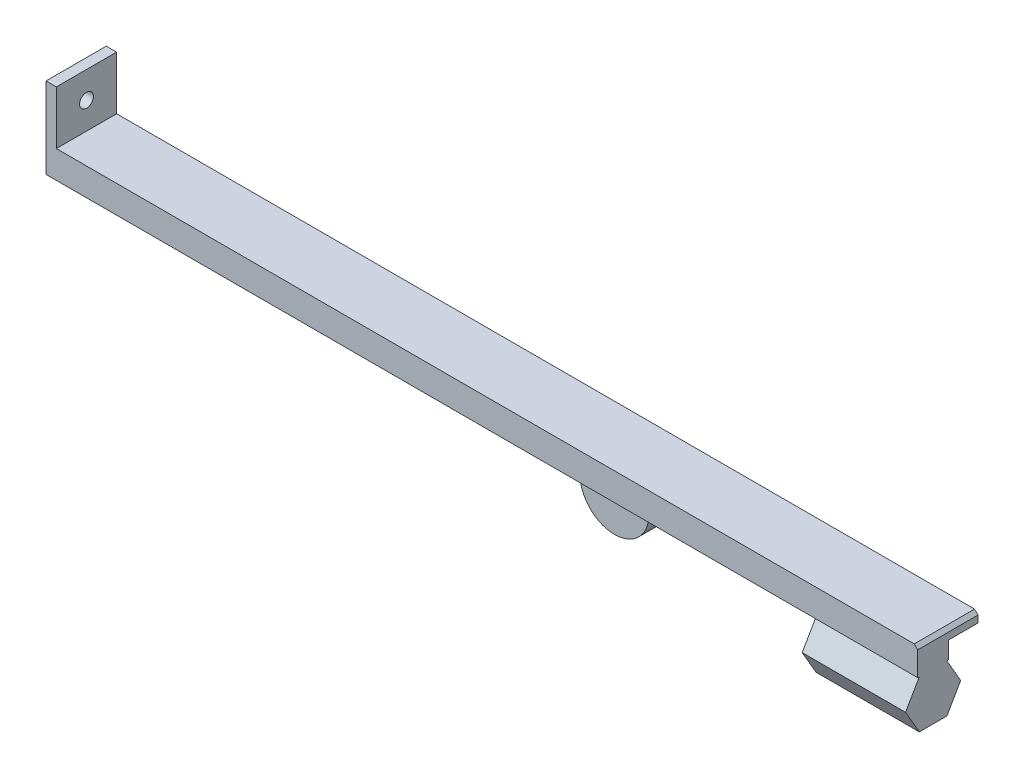
ISO-10303-21;
HEADER;
FILE_DESCRIPTION(('STEP AP214'),'2;1');
FILE_NAME('part.step','',(''),(''),'','','');
FILE_SCHEMA(('AUTOMOTIVE_DESIGN { 1 0 10303 214 1 1 1 1 }'));
ENDSEC;
DATA;
#1=APPLICATION_CONTEXT('core data for automotive mechanical design processes');
#2=APPLICATION_PROTOCOL_DEFINITION('international standard','automotive_design',2000,#1);
#3=PRODUCT_CONTEXT('',#1,'mechanical');
#4=PRODUCT('Part','Part','',(#3));
#5=PRODUCT_RELATED_PRODUCT_CATEGORY('part','',(#4));
#6=PRODUCT_DEFINITION_FORMATION('','',#4);
#7=PRODUCT_DEFINITION_CONTEXT('part definition',#1,'design');
#8=PRODUCT_DEFINITION('design','',#6,#7);
#9=PRODUCT_DEFINITION_SHAPE('','',#8);
#10=(LENGTH_UNIT() NAMED_UNIT(*) SI_UNIT(.MILLI.,.METRE.));
#11=(NAMED_UNIT(*) PLANE_ANGLE_UNIT() SI_UNIT($,.RADIAN.));
#12=(NAMED_UNIT(*) SI_UNIT($,.STERADIAN.) SOLID_ANGLE_UNIT());
#13=UNCERTAINTY_MEASURE_WITH_UNIT(LENGTH_MEASURE(1.E-05),#10,'distance_accuracy_value','');
#14=(GEOMETRIC_REPRESENTATION_CONTEXT(3) GLOBAL_UNCERTAINTY_ASSIGNED_CONTEXT((#13)) GLOBAL_UNIT_ASSIGNED_CONTEXT((#10,
#11,#12)) REPRESENTATION_CONTEXT('',''));
#15=CARTESIAN_POINT('',(0.,0.,0.));
#16=DIRECTION('',(0.,0.,1.));
#17=DIRECTION('',(1.,0.,0.));
#18=AXIS2_PLACEMENT_3D('',#15,#16,#17);
#19=CARTESIAN_POINT('',(0.,5.,8.5));
#20=DIRECTION('',(0.,1.,0.));
#21=DIRECTION('',(0.,0.,1.));
#22=AXIS2_PLACEMENT_3D('',#19,#20,#21);
#23=PLANE('',#22);
#24=DIRECTION('',(0.,0.,-1.));
#25=VECTOR('',#24,1.);
#26=CARTESIAN_POINT('',(163.,5.,8.5));
#27=LINE('',#26,#25);
#28=CARTESIAN_POINT('',(163.,5.,8.5));
#29=VERTEX_POINT('',#28);
#30=CARTESIAN_POINT('',(163.,5.,0.));
#31=VERTEX_POINT('',#30);
#32=EDGE_CURVE('E258',#29,#31,#27,.T.);
#33=ORIENTED_EDGE('',*,*,#32,.T.);
#34=DIRECTION('',(1.,0.,0.));
#35=VECTOR('',#34,1.);
#36=CARTESIAN_POINT('',(0.,5.,0.));
#37=LINE('',#36,#35);
#38=CARTESIAN_POINT('',(250.,5.,0.));
#39=VERTEX_POINT('',#38);
#40=EDGE_CURVE('E288',#31,#39,#37,.T.);
#41=ORIENTED_EDGE('',*,*,#40,.T.);
#42=DIRECTION('',(0.,0.,-1.));
#43=VECTOR('',#42,1.);
#44=CARTESIAN_POINT('',(250.,5.,8.5));
#45=LINE('',#44,#43);
#46=CARTESIAN_POINT('',(250.,5.,8.5));
#47=VERTEX_POINT('',#46);
#48=EDGE_CURVE('E283',#47,#39,#45,.T.);
#49=ORIENTED_EDGE('',*,*,#48,.F.);
#50=DIRECTION('',(1.,0.,0.));
#51=VECTOR('',#50,1.);
#52=CARTESIAN_POINT('',(0.,5.,8.5));
#53=LINE('',#52,#51);
#54=EDGE_CURVE('E272',#29,#47,#53,.T.);
#55=ORIENTED_EDGE('',*,*,#54,.F.);
#56=EDGE_LOOP('',(#33,#41,#49,#55));
#57=FACE_BOUND('',#56,.T.);
#58=ADVANCED_FACE('F37',(#57),#23,.F.);
#59=CARTESIAN_POINT('',(0.,0.,8.5));
#60=DIRECTION('',(0.,0.,1.));
#61=DIRECTION('',(1.,0.,0.));
#62=AXIS2_PLACEMENT_3D('',#59,#60,#61);
#63=PLANE('',#62);
#64=DIRECTION('',(0.,-1.,0.));
#65=VECTOR('',#64,1.);
#66=CARTESIAN_POINT('',(163.,0.,8.5));
#67=LINE('',#66,#65);
#68=CARTESIAN_POINT('',(163.,0.,8.5));
#69=VERTEX_POINT('',#68);
#70=EDGE_CURVE('E11',#29,#69,#67,.T.);
#71=ORIENTED_EDGE('',*,*,#70,.F.);
#72=ORIENTED_EDGE('',*,*,#54,.T.);
#73=DIRECTION('',(0.,1.,0.));
#74=VECTOR('',#73,1.);
#75=CARTESIAN_POINT('',(250.,0.,8.5));
#76=LINE('',#75,#74);
#77=CARTESIAN_POINT('',(250.,0.,8.5));
#78=VERTEX_POINT('',#77);
#79=EDGE_CURVE('E279',#78,#47,#76,.T.);
#80=ORIENTED_EDGE('',*,*,#79,.F.);
#81=DIRECTION('',(1.,0.,0.));
#82=VECTOR('',#81,1.);
#83=CARTESIAN_POINT('',(0.,0.,8.5));
#84=LINE('',#83,#82);
#85=EDGE_CURVE('E275',#69,#78,#84,.T.);
#86=ORIENTED_EDGE('',*,*,#85,.F.);
#87=EDGE_LOOP('',(#71,#72,#80,#86));
#88=FACE_BOUND('',#87,.T.);
#89=ADVANCED_FACE('F390',(#88),#63,.F.);
#90=CARTESIAN_POINT('',(0.,0.,17.5));
#91=DIRECTION('',(0.,1.,0.));
#92=DIRECTION('',(0.,0.,1.));
#93=AXIS2_PLACEMENT_3D('',#90,#91,#92);
#94=PLANE('',#93);
#95=DIRECTION('',(0.,0.,1.));
#96=VECTOR('',#95,1.);
#97=CARTESIAN_POINT('',(220.,-1.37845464209807E-12,9.02942890787891));
#98=LINE('',#97,#96);
#99=CARTESIAN_POINT('',(220.,-1.37845464209807E-12,9.02942890787891));
#100=VERTEX_POINT('',#99);
#101=CARTESIAN_POINT('',(220.,-1.32294349086681E-12,17.0294289078789));
#102=VERTEX_POINT('',#101);
#103=EDGE_CURVE('E198',#100,#102,#98,.T.);
#104=ORIENTED_EDGE('',*,*,#103,.T.);
#105=DIRECTION('',(1.,0.,0.));
#106=VECTOR('',#105,1.);
#107=CARTESIAN_POINT('',(220.,-1.32294349086681E-12,17.0294289078789));
#108=LINE('',#107,#106);
#109=CARTESIAN_POINT('',(250.,-1.32294349086681E-12,17.0294289078789));
#110=VERTEX_POINT('',#109);
#111=EDGE_CURVE('E230',#102,#110,#108,.T.);
#112=ORIENTED_EDGE('',*,*,#111,.T.);
#113=DIRECTION('',(0.,0.,-1.));
#114=VECTOR('',#113,1.);
#115=CARTESIAN_POINT('',(250.,0.,17.5));
#116=LINE('',#115,#114);
#117=CARTESIAN_POINT('',(250.,0.,17.5));
#118=VERTEX_POINT('',#117);
#119=EDGE_CURVE('E351',#118,#110,#116,.T.);
#120=ORIENTED_EDGE('',*,*,#119,.F.);
#121=DIRECTION('',(1.,0.,0.));
#122=VECTOR('',#121,1.);
#123=CARTESIAN_POINT('',(0.,0.,17.5));
#124=LINE('',#123,#122);
#125=CARTESIAN_POINT('',(-3.,0.,17.5));
#126=VERTEX_POINT('',#125);
#127=EDGE_CURVE('E298',#126,#118,#124,.T.);
#128=ORIENTED_EDGE('',*,*,#127,.F.);
#129=DIRECTION('',(0.,0.,-1.));
#130=VECTOR('',#129,1.);
#131=CARTESIAN_POINT('',(-3.,0.,17.5));
#132=LINE('',#131,#130);
#133=CARTESIAN_POINT('',(-3.,0.,0.));
#134=VERTEX_POINT('',#133);
#135=EDGE_CURVE('E319',#126,#134,#132,.T.);
#136=ORIENTED_EDGE('',*,*,#135,.T.);
#137=DIRECTION('',(1.,0.,0.));
#138=VECTOR('',#137,1.);
#139=CARTESIAN_POINT('',(0.,0.,0.));
#140=LINE('',#139,#138);
#141=CARTESIAN_POINT('',(0.,0.,0.));
#142=VERTEX_POINT('',#141);
#143=EDGE_CURVE('E297',#134,#142,#140,.T.);
#144=ORIENTED_EDGE('',*,*,#143,.T.);
#145=DIRECTION('',(0.,0.,-1.));
#146=VECTOR('',#145,1.);
#147=CARTESIAN_POINT('',(0.,0.,8.5));
#148=LINE('',#147,#146);
#149=CARTESIAN_POINT('',(0.,0.,8.5));
#150=VERTEX_POINT('',#149);
#151=EDGE_CURVE('E293',#150,#142,#148,.T.);
#152=ORIENTED_EDGE('',*,*,#151,.F.);
#153=CARTESIAN_POINT('',(143.,0.,8.5));
#154=VERTEX_POINT('',#153);
#155=EDGE_CURVE('E276',#150,#154,#84,.T.);
#156=ORIENTED_EDGE('',*,*,#155,.T.);
#157=EDGE_CURVE('E280',#154,#69,#84,.T.);
#158=ORIENTED_EDGE('',*,*,#157,.T.);
#159=ORIENTED_EDGE('',*,*,#85,.T.);
#160=CARTESIAN_POINT('',(250.,0.,9.02942890787891));
#161=VERTEX_POINT('',#160);
#162=EDGE_CURVE('E350',#161,#78,#116,.T.);
#163=ORIENTED_EDGE('',*,*,#162,.F.);
#164=DIRECTION('',(1.,0.,0.));
#165=VECTOR('',#164,1.);
#166=CARTESIAN_POINT('',(220.,-1.37845464209807E-12,9.02942890787891));
#167=LINE('',#166,#165);
#168=EDGE_CURVE('E187',#100,#161,#167,.T.);
#169=ORIENTED_EDGE('',*,*,#168,.F.);
#170=EDGE_LOOP('',(#104,#112,#120,#128,#136,#144,#152,#156,#158,#159,#163,#169));
#171=FACE_BOUND('',#170,.T.);
#172=ADVANCED_FACE('F39',(#171),#94,.F.);
#173=CARTESIAN_POINT('',(250.,0.,17.5));
#174=DIRECTION('',(1.,0.,0.));
#175=DIRECTION('',(0.,0.,-1.));
#176=AXIS2_PLACEMENT_3D('',#173,#174,#175);
#177=PLANE('',#176);
#178=ORIENTED_EDGE('',*,*,#48,.T.);
#179=DIRECTION('',(0.,-1.,0.));
#180=VECTOR('',#179,1.);
#181=CARTESIAN_POINT('',(250.,0.,0.));
#182=LINE('',#181,#180);
#183=CARTESIAN_POINT('',(250.,7.,0.));
#184=VERTEX_POINT('',#183);
#185=EDGE_CURVE('E322',#184,#39,#182,.T.);
#186=ORIENTED_EDGE('',*,*,#185,.F.);
#187=DIRECTION('',(0.,0.,-1.));
#188=VECTOR('',#187,1.);
#189=CARTESIAN_POINT('',(250.,7.,17.5));
#190=LINE('',#189,#188);
#191=CARTESIAN_POINT('',(250.,7.,17.5));
#192=VERTEX_POINT('',#191);
#193=EDGE_CURVE('E348',#192,#184,#190,.T.);
#194=ORIENTED_EDGE('',*,*,#193,.F.);
#195=DIRECTION('',(0.,-1.,0.));
#196=VECTOR('',#195,1.);
#197=CARTESIAN_POINT('',(250.,0.,17.5));
#198=LINE('',#197,#196);
#199=EDGE_CURVE('E300',#192,#118,#198,.T.);
#200=ORIENTED_EDGE('',*,*,#199,.T.);
#201=ORIENTED_EDGE('',*,*,#119,.T.);
#202=DIRECTION('',(0.,-0.866025403784435,0.500000000000006));
#203=VECTOR('',#202,1.);
#204=CARTESIAN_POINT('',(250.,-1.32294349086681E-12,17.0294289078789));
#205=LINE('',#204,#203);
#206=CARTESIAN_POINT('',(250.,-6.92820323027681,21.029428907879));
#207=VERTEX_POINT('',#206);
#208=EDGE_CURVE('E219',#110,#207,#205,.T.);
#209=ORIENTED_EDGE('',*,*,#208,.T.);
#210=DIRECTION('',(0.,-0.866025403784442,-0.499999999999994));
#211=VECTOR('',#210,1.);
#212=CARTESIAN_POINT('',(250.,-6.92820323027681,21.029428907879));
#213=LINE('',#212,#211);
#214=CARTESIAN_POINT('',(250.,-13.8564064605523,17.029428907879));
#215=VERTEX_POINT('',#214);
#216=EDGE_CURVE('E205',#207,#215,#213,.T.);
#217=ORIENTED_EDGE('',*,*,#216,.T.);
#218=DIRECTION('',(0.,0.,-1.));
#219=VECTOR('',#218,1.);
#220=CARTESIAN_POINT('',(250.,-13.8564064605523,17.029428907879));
#221=LINE('',#220,#219);
#222=CARTESIAN_POINT('',(250.,-13.8564064605524,9.02942890787901));
#223=VERTEX_POINT('',#222);
#224=EDGE_CURVE('E202',#215,#223,#221,.T.);
#225=ORIENTED_EDGE('',*,*,#224,.T.);
#226=DIRECTION('',(0.,0.866025403784436,-0.500000000000006));
#227=VECTOR('',#226,1.);
#228=CARTESIAN_POINT('',(250.,-13.8564064605524,9.02942890787901));
#229=LINE('',#228,#227);
#230=CARTESIAN_POINT('',(250.,-6.92820323027691,5.02942890787896));
#231=VERTEX_POINT('',#230);
#232=EDGE_CURVE('E216',#223,#231,#229,.T.);
#233=ORIENTED_EDGE('',*,*,#232,.T.);
#234=DIRECTION('',(0.,0.866025403784442,0.499999999999994));
#235=VECTOR('',#234,1.);
#236=CARTESIAN_POINT('',(250.,-6.92820323027691,5.02942890787896));
#237=LINE('',#236,#235);
#238=EDGE_CURVE('E52',#231,#161,#237,.T.);
#239=ORIENTED_EDGE('',*,*,#238,.T.);
#240=ORIENTED_EDGE('',*,*,#162,.T.);
#241=ORIENTED_EDGE('',*,*,#79,.T.);
#242=EDGE_LOOP('',(#178,#186,#194,#200,#201,#209,#217,#225,#233,#239,#240,#241));
#243=FACE_BOUND('',#242,.T.);
#244=ADVANCED_FACE('F393',(#243),#177,.T.);
#245=CARTESIAN_POINT('',(128.5,128.5,17.5));
#246=DIRECTION('',(0.707106781186547,0.707106781186548,0.));
#247=DIRECTION('',(-0.707106781186548,0.707106781186547,0.));
#248=AXIS2_PLACEMENT_3D('',#245,#246,#247);
#249=PLANE('',#248);
#250=DIRECTION('',(0.707106781186548,-0.707106781186547,0.));
#251=VECTOR('',#250,1.);
#252=CARTESIAN_POINT('',(128.5,128.5,0.));
#253=LINE('',#252,#251);
#254=CARTESIAN_POINT('',(249.,8.,0.));
#255=VERTEX_POINT('',#254);
#256=EDGE_CURVE('E325',#255,#184,#253,.T.);
#257=ORIENTED_EDGE('',*,*,#256,.F.);
#258=DIRECTION('',(0.,0.,-1.));
#259=VECTOR('',#258,1.);
#260=CARTESIAN_POINT('',(249.,8.,17.5));
#261=LINE('',#260,#259);
#262=CARTESIAN_POINT('',(249.,8.,17.5));
#263=VERTEX_POINT('',#262);
#264=EDGE_CURVE('E346',#263,#255,#261,.T.);
#265=ORIENTED_EDGE('',*,*,#264,.F.);
#266=DIRECTION('',(0.707106781186548,-0.707106781186547,0.));
#267=VECTOR('',#266,1.);
#268=CARTESIAN_POINT('',(128.5,128.5,17.5));
#269=LINE('',#268,#267);
#270=EDGE_CURVE('E304',#263,#192,#269,.T.);
#271=ORIENTED_EDGE('',*,*,#270,.T.);
#272=ORIENTED_EDGE('',*,*,#193,.T.);
#273=EDGE_LOOP('',(#257,#265,#271,#272));
#274=FACE_BOUND('',#273,.T.);
#275=ADVANCED_FACE('F400',(#274),#249,.T.);
#276=CARTESIAN_POINT('',(0.,8.,17.5));
#277=DIRECTION('',(0.,1.,0.));
#278=DIRECTION('',(0.,0.,1.));
#279=AXIS2_PLACEMENT_3D('',#276,#277,#278);
#280=PLANE('',#279);
#281=DIRECTION('',(1.,0.,0.));
#282=VECTOR('',#281,1.);
#283=CARTESIAN_POINT('',(0.,8.,0.));
#284=LINE('',#283,#282);
#285=CARTESIAN_POINT('',(0.,8.,0.));
#286=VERTEX_POINT('',#285);
#287=EDGE_CURVE('E328',#286,#255,#284,.T.);
#288=ORIENTED_EDGE('',*,*,#287,.F.);
#289=DIRECTION('',(0.,0.,-1.));
#290=VECTOR('',#289,1.);
#291=CARTESIAN_POINT('',(0.,8.,17.5));
#292=LINE('',#291,#290);
#293=CARTESIAN_POINT('',(0.,8.,17.5));
#294=VERTEX_POINT('',#293);
#295=EDGE_CURVE('E344',#294,#286,#292,.T.);
#296=ORIENTED_EDGE('',*,*,#295,.F.);
#297=DIRECTION('',(1.,0.,0.));
#298=VECTOR('',#297,1.);
#299=CARTESIAN_POINT('',(0.,8.,17.5));
#300=LINE('',#299,#298);
#301=EDGE_CURVE('E307',#294,#263,#300,.T.);
#302=ORIENTED_EDGE('',*,*,#301,.T.);
#303=ORIENTED_EDGE('',*,*,#264,.T.);
#304=EDGE_LOOP('',(#288,#296,#302,#303));
#305=FACE_BOUND('',#304,.T.);
#306=ADVANCED_FACE('F458',(#305),#280,.T.);
#307=CARTESIAN_POINT('',(0.,0.,17.5));
#308=DIRECTION('',(1.,0.,0.));
#309=DIRECTION('',(0.,0.,-1.));
#310=AXIS2_PLACEMENT_3D('',#307,#308,#309);
#311=PLANE('',#310);
#312=CARTESIAN_POINT('',(0.,15.75,8.75));
#313=DIRECTION('',(1.,0.,0.));
#314=DIRECTION('',(0.,0.,-1.));
#315=AXIS2_PLACEMENT_3D('',#312,#313,#314);
#316=CIRCLE('',#315,2.);
#317=CARTESIAN_POINT('',(0.,15.75,6.75));
#318=VERTEX_POINT('',#317);
#319=EDGE_CURVE('E264',#318,#318,#316,.T.);
#320=ORIENTED_EDGE('',*,*,#319,.F.);
#321=EDGE_LOOP('',(#320));
#322=FACE_BOUND('',#321,.T.);
#323=DIRECTION('',(0.,-1.,0.));
#324=VECTOR('',#323,1.);
#325=CARTESIAN_POINT('',(0.,0.,0.));
#326=LINE('',#325,#324);
#327=CARTESIAN_POINT('',(0.,23.5,0.));
#328=VERTEX_POINT('',#327);
#329=EDGE_CURVE('E331',#328,#286,#326,.T.);
#330=ORIENTED_EDGE('',*,*,#329,.F.);
#331=DIRECTION('',(0.,0.,-1.));
#332=VECTOR('',#331,1.);
#333=CARTESIAN_POINT('',(0.,23.5,17.5));
#334=LINE('',#333,#332);
#335=CARTESIAN_POINT('',(0.,23.5,17.5));
#336=VERTEX_POINT('',#335);
#337=EDGE_CURVE('E342',#336,#328,#334,.T.);
#338=ORIENTED_EDGE('',*,*,#337,.F.);
#339=DIRECTION('',(0.,-1.,0.));
#340=VECTOR('',#339,1.);
#341=CARTESIAN_POINT('',(0.,0.,17.5));
#342=LINE('',#341,#340);
#343=EDGE_CURVE('E310',#336,#294,#342,.T.);
#344=ORIENTED_EDGE('',*,*,#343,.T.);
#345=ORIENTED_EDGE('',*,*,#295,.T.);
#346=EDGE_LOOP('',(#330,#338,#344,#345));
#347=FACE_BOUND('',#346,.T.);
#348=ADVANCED_FACE('F454',(#322,#347),#311,.T.);
#349=CARTESIAN_POINT('',(0.,23.5,17.5));
#350=DIRECTION('',(0.,1.,0.));
#351=DIRECTION('',(0.,0.,1.));
#352=AXIS2_PLACEMENT_3D('',#349,#350,#351);
#353=PLANE('',#352);
#354=DIRECTION('',(1.,0.,0.));
#355=VECTOR('',#354,1.);
#356=CARTESIAN_POINT('',(0.,23.5,0.));
#357=LINE('',#356,#355);
#358=CARTESIAN_POINT('',(-3.,23.5,0.));
#359=VERTEX_POINT('',#358);
#360=EDGE_CURVE('E334',#359,#328,#357,.T.);
#361=ORIENTED_EDGE('',*,*,#360,.F.);
#362=DIRECTION('',(0.,0.,-1.));
#363=VECTOR('',#362,1.);
#364=CARTESIAN_POINT('',(-3.,23.5,17.5));
#365=LINE('',#364,#363);
#366=CARTESIAN_POINT('',(-3.,23.5,17.5));
#367=VERTEX_POINT('',#366);
#368=EDGE_CURVE('E340',#367,#359,#365,.T.);
#369=ORIENTED_EDGE('',*,*,#368,.F.);
#370=DIRECTION('',(1.,0.,0.));
#371=VECTOR('',#370,1.);
#372=CARTESIAN_POINT('',(0.,23.5,17.5));
#373=LINE('',#372,#371);
#374=EDGE_CURVE('E313',#367,#336,#373,.T.);
#375=ORIENTED_EDGE('',*,*,#374,.T.);
#376=ORIENTED_EDGE('',*,*,#337,.T.);
#377=EDGE_LOOP('',(#361,#369,#375,#376));
#378=FACE_BOUND('',#377,.T.);
#379=ADVANCED_FACE('F450',(#378),#353,.T.);
#380=CARTESIAN_POINT('',(-3.,0.,17.5));
#381=DIRECTION('',(-1.,0.,0.));
#382=DIRECTION('',(0.,0.,1.));
#383=AXIS2_PLACEMENT_3D('',#380,#381,#382);
#384=PLANE('',#383);
#385=CARTESIAN_POINT('',(-3.,15.75,8.75));
#386=DIRECTION('',(-1.,0.,0.));
#387=DIRECTION('',(0.,0.,1.));
#388=AXIS2_PLACEMENT_3D('',#385,#386,#387);
#389=CIRCLE('',#388,2.);
#390=CARTESIAN_POINT('',(-3.,15.75,10.75));
#391=VERTEX_POINT('',#390);
#392=EDGE_CURVE('E267',#391,#391,#389,.T.);
#393=ORIENTED_EDGE('',*,*,#392,.F.);
#394=EDGE_LOOP('',(#393));
#395=FACE_BOUND('',#394,.T.);
#396=DIRECTION('',(0.,1.,0.));
#397=VECTOR('',#396,1.);
#398=CARTESIAN_POINT('',(-3.,0.,0.));
#399=LINE('',#398,#397);
#400=EDGE_CURVE('E301',#134,#359,#399,.T.);
#401=ORIENTED_EDGE('',*,*,#400,.F.);
#402=ORIENTED_EDGE('',*,*,#135,.F.);
#403=DIRECTION('',(0.,1.,0.));
#404=VECTOR('',#403,1.);
#405=CARTESIAN_POINT('',(-3.,0.,17.5));
#406=LINE('',#405,#404);
#407=EDGE_CURVE('E316',#126,#367,#406,.T.);
#408=ORIENTED_EDGE('',*,*,#407,.T.);
#409=ORIENTED_EDGE('',*,*,#368,.T.);
#410=EDGE_LOOP('',(#401,#402,#408,#409));
#411=FACE_BOUND('',#410,.T.);
#412=ADVANCED_FACE('F446',(#395,#411),#384,.T.);
#413=CARTESIAN_POINT('',(0.,0.,17.5));
#414=DIRECTION('',(0.,0.,1.));
#415=DIRECTION('',(1.,0.,0.));
#416=AXIS2_PLACEMENT_3D('',#413,#414,#415);
#417=PLANE('',#416);
#418=ORIENTED_EDGE('',*,*,#127,.T.);
#419=ORIENTED_EDGE('',*,*,#199,.F.);
#420=ORIENTED_EDGE('',*,*,#270,.F.);
#421=ORIENTED_EDGE('',*,*,#301,.F.);
#422=ORIENTED_EDGE('',*,*,#343,.F.);
#423=ORIENTED_EDGE('',*,*,#374,.F.);
#424=ORIENTED_EDGE('',*,*,#407,.F.);
#425=EDGE_LOOP('',(#418,#419,#420,#421,#422,#423,#424));
#426=FACE_BOUND('',#425,.T.);
#427=ADVANCED_FACE('F404',(#426),#417,.T.);
#428=CARTESIAN_POINT('',(0.,0.,0.));
#429=DIRECTION('',(0.,0.,1.));
#430=DIRECTION('',(1.,0.,0.));
#431=AXIS2_PLACEMENT_3D('',#428,#429,#430);
#432=PLANE('',#431);
#433=ORIENTED_EDGE('',*,*,#185,.T.);
#434=ORIENTED_EDGE('',*,*,#40,.F.);
#435=DIRECTION('',(0.,1.,0.));
#436=VECTOR('',#435,1.);
#437=CARTESIAN_POINT('',(163.,0.,0.));
#438=LINE('',#437,#436);
#439=CARTESIAN_POINT('',(163.,-7.,0.));
#440=VERTEX_POINT('',#439);
#441=EDGE_CURVE('E248',#440,#31,#438,.T.);
#442=ORIENTED_EDGE('',*,*,#441,.F.);
#443=CARTESIAN_POINT('',(153.,-7.,0.));
#444=DIRECTION('',(0.,0.,1.));
#445=DIRECTION('',(1.,0.,0.));
#446=AXIS2_PLACEMENT_3D('',#443,#444,#445);
#447=CIRCLE('',#446,9.99999999999999);
#448=CARTESIAN_POINT('',(143.,-7.,0.));
#449=VERTEX_POINT('',#448);
#450=EDGE_CURVE('E225',#449,#440,#447,.T.);
#451=ORIENTED_EDGE('',*,*,#450,.F.);
#452=DIRECTION('',(0.,1.,0.));
#453=VECTOR('',#452,1.);
#454=CARTESIAN_POINT('',(143.,0.,0.));
#455=LINE('',#454,#453);
#456=CARTESIAN_POINT('',(143.,5.,0.));
#457=VERTEX_POINT('',#456);
#458=EDGE_CURVE('E250',#449,#457,#455,.T.);
#459=ORIENTED_EDGE('',*,*,#458,.T.);
#460=CARTESIAN_POINT('',(0.,5.,0.));
#461=VERTEX_POINT('',#460);
#462=EDGE_CURVE('E284',#461,#457,#37,.T.);
#463=ORIENTED_EDGE('',*,*,#462,.F.);
#464=DIRECTION('',(0.,1.,0.));
#465=VECTOR('',#464,1.);
#466=CARTESIAN_POINT('',(0.,0.,0.));
#467=LINE('',#466,#465);
#468=EDGE_CURVE('E287',#142,#461,#467,.T.);
#469=ORIENTED_EDGE('',*,*,#468,.F.);
#470=ORIENTED_EDGE('',*,*,#143,.F.);
#471=ORIENTED_EDGE('',*,*,#400,.T.);
#472=ORIENTED_EDGE('',*,*,#360,.T.);
#473=ORIENTED_EDGE('',*,*,#329,.T.);
#474=ORIENTED_EDGE('',*,*,#287,.T.);
#475=ORIENTED_EDGE('',*,*,#256,.T.);
#476=EDGE_LOOP('',(#433,#434,#442,#451,#459,#463,#469,#470,#471,#472,#473,#474,#475));
#477=FACE_BOUND('',#476,.T.);
#478=CARTESIAN_POINT('',(153.,-7.,0.));
#479=DIRECTION('',(0.,0.,1.));
#480=DIRECTION('',(1.,0.,0.));
#481=AXIS2_PLACEMENT_3D('',#478,#479,#480);
#482=CIRCLE('',#481,2.);
#483=CARTESIAN_POINT('',(155.,-7.,0.));
#484=VERTEX_POINT('',#483);
#485=EDGE_CURVE('E238',#484,#484,#482,.T.);
#486=ORIENTED_EDGE('',*,*,#485,.T.);
#487=EDGE_LOOP('',(#486));
#488=FACE_BOUND('',#487,.T.);
#489=ADVANCED_FACE('F371',(#477,#488),#432,.F.);
#490=ORIENTED_EDGE('',*,*,#462,.T.);
#491=DIRECTION('',(0.,0.,-1.));
#492=VECTOR('',#491,1.);
#493=CARTESIAN_POINT('',(143.,5.,8.5));
#494=LINE('',#493,#492);
#495=CARTESIAN_POINT('',(143.,5.,8.5));
#496=VERTEX_POINT('',#495);
#497=EDGE_CURVE('E256',#496,#457,#494,.T.);
#498=ORIENTED_EDGE('',*,*,#497,.F.);
#499=CARTESIAN_POINT('',(0.,5.,8.5));
#500=VERTEX_POINT('',#499);
#501=EDGE_CURVE('E268',#500,#496,#53,.T.);
#502=ORIENTED_EDGE('',*,*,#501,.F.);
#503=DIRECTION('',(0.,0.,-1.));
#504=VECTOR('',#503,1.);
#505=CARTESIAN_POINT('',(0.,5.,8.5));
#506=LINE('',#505,#504);
#507=EDGE_CURVE('E295',#500,#461,#506,.T.);
#508=ORIENTED_EDGE('',*,*,#507,.T.);
#509=EDGE_LOOP('',(#490,#498,#502,#508));
#510=FACE_BOUND('',#509,.T.);
#511=ADVANCED_FACE('F377',(#510),#23,.F.);
#512=CARTESIAN_POINT('',(0.,0.,8.5));
#513=DIRECTION('',(-1.,0.,0.));
#514=DIRECTION('',(0.,0.,1.));
#515=AXIS2_PLACEMENT_3D('',#512,#513,#514);
#516=PLANE('',#515);
#517=ORIENTED_EDGE('',*,*,#468,.T.);
#518=ORIENTED_EDGE('',*,*,#507,.F.);
#519=DIRECTION('',(0.,1.,0.));
#520=VECTOR('',#519,1.);
#521=CARTESIAN_POINT('',(0.,0.,8.5));
#522=LINE('',#521,#520);
#523=EDGE_CURVE('E271',#150,#500,#522,.T.);
#524=ORIENTED_EDGE('',*,*,#523,.F.);
#525=ORIENTED_EDGE('',*,*,#151,.T.);
#526=EDGE_LOOP('',(#517,#518,#524,#525));
#527=FACE_BOUND('',#526,.T.);
#528=ADVANCED_FACE('F368',(#527),#516,.F.);
#529=ORIENTED_EDGE('',*,*,#501,.T.);
#530=DIRECTION('',(0.,-1.,0.));
#531=VECTOR('',#530,1.);
#532=CARTESIAN_POINT('',(143.,0.,8.5));
#533=LINE('',#532,#531);
#534=EDGE_CURVE('E45',#496,#154,#533,.T.);
#535=ORIENTED_EDGE('',*,*,#534,.T.);
#536=ORIENTED_EDGE('',*,*,#155,.F.);
#537=ORIENTED_EDGE('',*,*,#523,.T.);
#538=EDGE_LOOP('',(#529,#535,#536,#537));
#539=FACE_BOUND('',#538,.T.);
#540=ADVANCED_FACE('F357',(#539),#63,.F.);
#541=CARTESIAN_POINT('',(-8.5,15.75,8.75));
#542=DIRECTION('',(1.,0.,0.));
#543=DIRECTION('',(0.,0.,-1.));
#544=AXIS2_PLACEMENT_3D('',#541,#542,#543);
#545=CYLINDRICAL_SURFACE('',#544,2.);
#546=ORIENTED_EDGE('',*,*,#392,.T.);
#547=EDGE_LOOP('',(#546));
#548=FACE_BOUND('',#547,.T.);
#549=ORIENTED_EDGE('',*,*,#319,.T.);
#550=EDGE_LOOP('',(#549));
#551=FACE_BOUND('',#550,.T.);
#552=ADVANCED_FACE('F500',(#548,#551),#545,.F.);
#553=CARTESIAN_POINT('',(0.,0.,8.5));
#554=DIRECTION('',(0.,0.,1.));
#555=DIRECTION('',(1.,0.,0.));
#556=AXIS2_PLACEMENT_3D('',#553,#554,#555);
#557=PLANE('',#556);
#558=CARTESIAN_POINT('',(153.,-7.,8.5));
#559=DIRECTION('',(0.,0.,1.));
#560=DIRECTION('',(1.,0.,0.));
#561=AXIS2_PLACEMENT_3D('',#558,#559,#560);
#562=CIRCLE('',#561,2.);
#563=CARTESIAN_POINT('',(155.,-7.,8.5));
#564=VERTEX_POINT('',#563);
#565=EDGE_CURVE('E242',#564,#564,#562,.T.);
#566=ORIENTED_EDGE('',*,*,#565,.F.);
#567=EDGE_LOOP('',(#566));
#568=FACE_BOUND('',#567,.T.);
#569=ORIENTED_EDGE('',*,*,#157,.F.);
#570=DIRECTION('',(0.,1.,0.));
#571=VECTOR('',#570,1.);
#572=CARTESIAN_POINT('',(143.,0.,8.5));
#573=LINE('',#572,#571);
#574=CARTESIAN_POINT('',(143.,-7.,8.5));
#575=VERTEX_POINT('',#574);
#576=EDGE_CURVE('E60',#575,#154,#573,.T.);
#577=ORIENTED_EDGE('',*,*,#576,.F.);
#578=CARTESIAN_POINT('',(153.,-7.,8.5));
#579=DIRECTION('',(0.,0.,1.));
#580=DIRECTION('',(1.,0.,0.));
#581=AXIS2_PLACEMENT_3D('',#578,#579,#580);
#582=CIRCLE('',#581,9.99999999999999);
#583=CARTESIAN_POINT('',(163.,-7.,8.5));
#584=VERTEX_POINT('',#583);
#585=EDGE_CURVE('E234',#575,#584,#582,.T.);
#586=ORIENTED_EDGE('',*,*,#585,.T.);
#587=DIRECTION('',(0.,1.,0.));
#588=VECTOR('',#587,1.);
#589=CARTESIAN_POINT('',(163.,0.,8.5));
#590=LINE('',#589,#588);
#591=EDGE_CURVE('E237',#584,#69,#590,.T.);
#592=ORIENTED_EDGE('',*,*,#591,.T.);
#593=EDGE_LOOP('',(#569,#577,#586,#592));
#594=FACE_BOUND('',#593,.T.);
#595=ADVANCED_FACE('F384',(#568,#594),#557,.T.);
#596=CARTESIAN_POINT('',(153.,-7.,8.5));
#597=DIRECTION('',(0.,0.,-1.));
#598=DIRECTION('',(-1.,0.,0.));
#599=AXIS2_PLACEMENT_3D('',#596,#597,#598);
#600=CYLINDRICAL_SURFACE('',#599,9.99999999999999);
#601=ORIENTED_EDGE('',*,*,#450,.T.);
#602=DIRECTION('',(0.,0.,-1.));
#603=VECTOR('',#602,1.);
#604=CARTESIAN_POINT('',(163.,-7.,8.5));
#605=LINE('',#604,#603);
#606=EDGE_CURVE('E261',#584,#440,#605,.T.);
#607=ORIENTED_EDGE('',*,*,#606,.F.);
#608=ORIENTED_EDGE('',*,*,#585,.F.);
#609=DIRECTION('',(0.,0.,-1.));
#610=VECTOR('',#609,1.);
#611=CARTESIAN_POINT('',(143.,-7.,8.5));
#612=LINE('',#611,#610);
#613=EDGE_CURVE('E245',#575,#449,#612,.T.);
#614=ORIENTED_EDGE('',*,*,#613,.T.);
#615=EDGE_LOOP('',(#601,#607,#608,#614));
#616=FACE_BOUND('',#615,.T.);
#617=ADVANCED_FACE('F382',(#616),#600,.T.);
#618=CARTESIAN_POINT('',(163.,0.,8.5));
#619=DIRECTION('',(-1.,0.,0.));
#620=DIRECTION('',(0.,0.,1.));
#621=AXIS2_PLACEMENT_3D('',#618,#619,#620);
#622=PLANE('',#621);
#623=ORIENTED_EDGE('',*,*,#441,.T.);
#624=ORIENTED_EDGE('',*,*,#32,.F.);
#625=ORIENTED_EDGE('',*,*,#70,.T.);
#626=ORIENTED_EDGE('',*,*,#591,.F.);
#627=ORIENTED_EDGE('',*,*,#606,.T.);
#628=EDGE_LOOP('',(#623,#624,#625,#626,#627));
#629=FACE_BOUND('',#628,.T.);
#630=ADVANCED_FACE('F521',(#629),#622,.F.);
#631=CARTESIAN_POINT('',(143.,0.,8.5));
#632=DIRECTION('',(-1.,0.,0.));
#633=DIRECTION('',(0.,0.,1.));
#634=AXIS2_PLACEMENT_3D('',#631,#632,#633);
#635=PLANE('',#634);
#636=ORIENTED_EDGE('',*,*,#458,.F.);
#637=ORIENTED_EDGE('',*,*,#613,.F.);
#638=ORIENTED_EDGE('',*,*,#576,.T.);
#639=ORIENTED_EDGE('',*,*,#534,.F.);
#640=ORIENTED_EDGE('',*,*,#497,.T.);
#641=EDGE_LOOP('',(#636,#637,#638,#639,#640));
#642=FACE_BOUND('',#641,.T.);
#643=ADVANCED_FACE('F378',(#642),#635,.T.);
#644=CARTESIAN_POINT('',(153.,-7.,8.5));
#645=DIRECTION('',(0.,0.,-1.));
#646=DIRECTION('',(-1.,0.,0.));
#647=AXIS2_PLACEMENT_3D('',#644,#645,#646);
#648=CYLINDRICAL_SURFACE('',#647,2.);
#649=ORIENTED_EDGE('',*,*,#565,.T.);
#650=EDGE_LOOP('',(#649));
#651=FACE_BOUND('',#650,.T.);
#652=ORIENTED_EDGE('',*,*,#485,.F.);
#653=EDGE_LOOP('',(#652));
#654=FACE_BOUND('',#653,.T.);
#655=ADVANCED_FACE('F426',(#651,#654),#648,.F.);
#656=CARTESIAN_POINT('',(220.,-13.8564064605524,9.02942890787901));
#657=DIRECTION('',(0.,-0.500000000000005,-0.866025403784435));
#658=DIRECTION('',(0.,0.866025403784436,-0.500000000000006));
#659=AXIS2_PLACEMENT_3D('',#656,#657,#658);
#660=PLANE('',#659);
#661=ORIENTED_EDGE('',*,*,#232,.F.);
#662=DIRECTION('',(1.,0.,0.));
#663=VECTOR('',#662,1.);
#664=CARTESIAN_POINT('',(220.,-13.8564064605524,9.02942890787901));
#665=LINE('',#664,#663);
#666=CARTESIAN_POINT('',(220.,-13.8564064605524,9.02942890787901));
#667=VERTEX_POINT('',#666);
#668=EDGE_CURVE('E201',#667,#223,#665,.T.);
#669=ORIENTED_EDGE('',*,*,#668,.F.);
#670=DIRECTION('',(0.,0.866025403784436,-0.500000000000006));
#671=VECTOR('',#670,1.);
#672=CARTESIAN_POINT('',(220.,-13.8564064605524,9.02942890787901));
#673=LINE('',#672,#671);
#674=CARTESIAN_POINT('',(220.,-6.92820323027691,5.02942890787896));
#675=VERTEX_POINT('',#674);
#676=EDGE_CURVE('E194',#667,#675,#673,.T.);
#677=ORIENTED_EDGE('',*,*,#676,.T.);
#678=DIRECTION('',(1.,0.,0.));
#679=VECTOR('',#678,1.);
#680=CARTESIAN_POINT('',(220.,-6.92820323027691,5.02942890787896));
#681=LINE('',#680,#679);
#682=EDGE_CURVE('E179',#675,#231,#681,.T.);
#683=ORIENTED_EDGE('',*,*,#682,.T.);
#684=EDGE_LOOP('',(#661,#669,#677,#683));
#685=FACE_BOUND('',#684,.T.);
#686=ADVANCED_FACE('F200',(#685),#660,.T.);
#687=CARTESIAN_POINT('',(220.,-13.8564064605523,17.029428907879));
#688=DIRECTION('',(0.,-1.,0.));
#689=DIRECTION('',(0.,0.,-1.));
#690=AXIS2_PLACEMENT_3D('',#687,#688,#689);
#691=PLANE('',#690);
#692=ORIENTED_EDGE('',*,*,#224,.F.);
#693=DIRECTION('',(1.,0.,0.));
#694=VECTOR('',#693,1.);
#695=CARTESIAN_POINT('',(220.,-13.8564064605523,17.029428907879));
#696=LINE('',#695,#694);
#697=CARTESIAN_POINT('',(220.,-13.8564064605523,17.029428907879));
#698=VERTEX_POINT('',#697);
#699=EDGE_CURVE('E226',#698,#215,#696,.T.);
#700=ORIENTED_EDGE('',*,*,#699,.F.);
#701=DIRECTION('',(0.,0.,-1.));
#702=VECTOR('',#701,1.);
#703=CARTESIAN_POINT('',(220.,-13.8564064605523,17.029428907879));
#704=LINE('',#703,#702);
#705=EDGE_CURVE('E188',#698,#667,#704,.T.);
#706=ORIENTED_EDGE('',*,*,#705,.T.);
#707=ORIENTED_EDGE('',*,*,#668,.T.);
#708=EDGE_LOOP('',(#692,#700,#706,#707));
#709=FACE_BOUND('',#708,.T.);
#710=ADVANCED_FACE('F418',(#709),#691,.T.);
#711=CARTESIAN_POINT('',(220.,-6.92820323027681,21.029428907879));
#712=DIRECTION('',(0.,-0.499999999999994,0.866025403784442));
#713=DIRECTION('',(0.,-0.866025403784442,-0.499999999999994));
#714=AXIS2_PLACEMENT_3D('',#711,#712,#713);
#715=PLANE('',#714);
#716=ORIENTED_EDGE('',*,*,#216,.F.);
#717=DIRECTION('',(1.,0.,0.));
#718=VECTOR('',#717,1.);
#719=CARTESIAN_POINT('',(220.,-6.92820323027681,21.029428907879));
#720=LINE('',#719,#718);
#721=CARTESIAN_POINT('',(220.,-6.92820323027681,21.029428907879));
#722=VERTEX_POINT('',#721);
#723=EDGE_CURVE('E228',#722,#207,#720,.T.);
#724=ORIENTED_EDGE('',*,*,#723,.F.);
#725=DIRECTION('',(0.,-0.866025403784442,-0.499999999999994));
#726=VECTOR('',#725,1.);
#727=CARTESIAN_POINT('',(220.,-6.92820323027681,21.029428907879));
#728=LINE('',#727,#726);
#729=EDGE_CURVE('E212',#722,#698,#728,.T.);
#730=ORIENTED_EDGE('',*,*,#729,.T.);
#731=ORIENTED_EDGE('',*,*,#699,.T.);
#732=EDGE_LOOP('',(#716,#724,#730,#731));
#733=FACE_BOUND('',#732,.T.);
#734=ADVANCED_FACE('F416',(#733),#715,.T.);
#735=CARTESIAN_POINT('',(220.,-1.32294349086681E-12,17.0294289078789));
#736=DIRECTION('',(0.,0.500000000000006,0.866025403784435));
#737=DIRECTION('',(0.,-0.866025403784435,0.500000000000006));
#738=AXIS2_PLACEMENT_3D('',#735,#736,#737);
#739=PLANE('',#738);
#740=ORIENTED_EDGE('',*,*,#208,.F.);
#741=ORIENTED_EDGE('',*,*,#111,.F.);
#742=DIRECTION('',(0.,-0.866025403784435,0.500000000000006));
#743=VECTOR('',#742,1.);
#744=CARTESIAN_POINT('',(220.,-1.32294349086681E-12,17.0294289078789));
#745=LINE('',#744,#743);
#746=EDGE_CURVE('E209',#102,#722,#745,.T.);
#747=ORIENTED_EDGE('',*,*,#746,.T.);
#748=ORIENTED_EDGE('',*,*,#723,.T.);
#749=EDGE_LOOP('',(#740,#741,#747,#748));
#750=FACE_BOUND('',#749,.T.);
#751=ADVANCED_FACE('F413',(#750),#739,.T.);
#752=CARTESIAN_POINT('',(220.,-6.92820323027691,5.02942890787896));
#753=DIRECTION('',(0.,0.499999999999994,-0.866025403784442));
#754=DIRECTION('',(0.,0.866025403784442,0.499999999999994));
#755=AXIS2_PLACEMENT_3D('',#752,#753,#754);
#756=PLANE('',#755);
#757=ORIENTED_EDGE('',*,*,#238,.F.);
#758=ORIENTED_EDGE('',*,*,#682,.F.);
#759=DIRECTION('',(0.,0.866025403784442,0.499999999999994));
#760=VECTOR('',#759,1.);
#761=CARTESIAN_POINT('',(220.,-6.92820323027691,5.02942890787896));
#762=LINE('',#761,#760);
#763=EDGE_CURVE('E182',#675,#100,#762,.T.);
#764=ORIENTED_EDGE('',*,*,#763,.T.);
#765=ORIENTED_EDGE('',*,*,#168,.T.);
#766=EDGE_LOOP('',(#757,#758,#764,#765));
#767=FACE_BOUND('',#766,.T.);
#768=ADVANCED_FACE('F181',(#767),#756,.T.);
#769=CARTESIAN_POINT('',(220.,0.,0.));
#770=DIRECTION('',(1.,0.,0.));
#771=DIRECTION('',(0.,0.,-1.));
#772=AXIS2_PLACEMENT_3D('',#769,#770,#771);
#773=PLANE('',#772);
#774=ORIENTED_EDGE('',*,*,#676,.F.);
#775=ORIENTED_EDGE('',*,*,#705,.F.);
#776=ORIENTED_EDGE('',*,*,#729,.F.);
#777=ORIENTED_EDGE('',*,*,#746,.F.);
#778=ORIENTED_EDGE('',*,*,#103,.F.);
#779=ORIENTED_EDGE('',*,*,#763,.F.);
#780=EDGE_LOOP('',(#774,#775,#776,#777,#778,#779));
#781=FACE_BOUND('',#780,.T.);
#782=ADVANCED_FACE('F192',(#781),#773,.F.);
#783=CLOSED_SHELL('',(#58,#89,#172,#244,#275,#306,#348,#379,#412,#427,#489,#511,#528,#540,#552,
#595,#617,#630,#643,#655,#686,#710,#734,#751,#768,#782));
#784=MANIFOLD_SOLID_BREP('B2',#783);
#785=ADVANCED_BREP_SHAPE_REPRESENTATION('',(#18,#784),#14);
#786=SHAPE_DEFINITION_REPRESENTATION(#9,#785);
ENDSEC;
END-ISO-10303-21;
